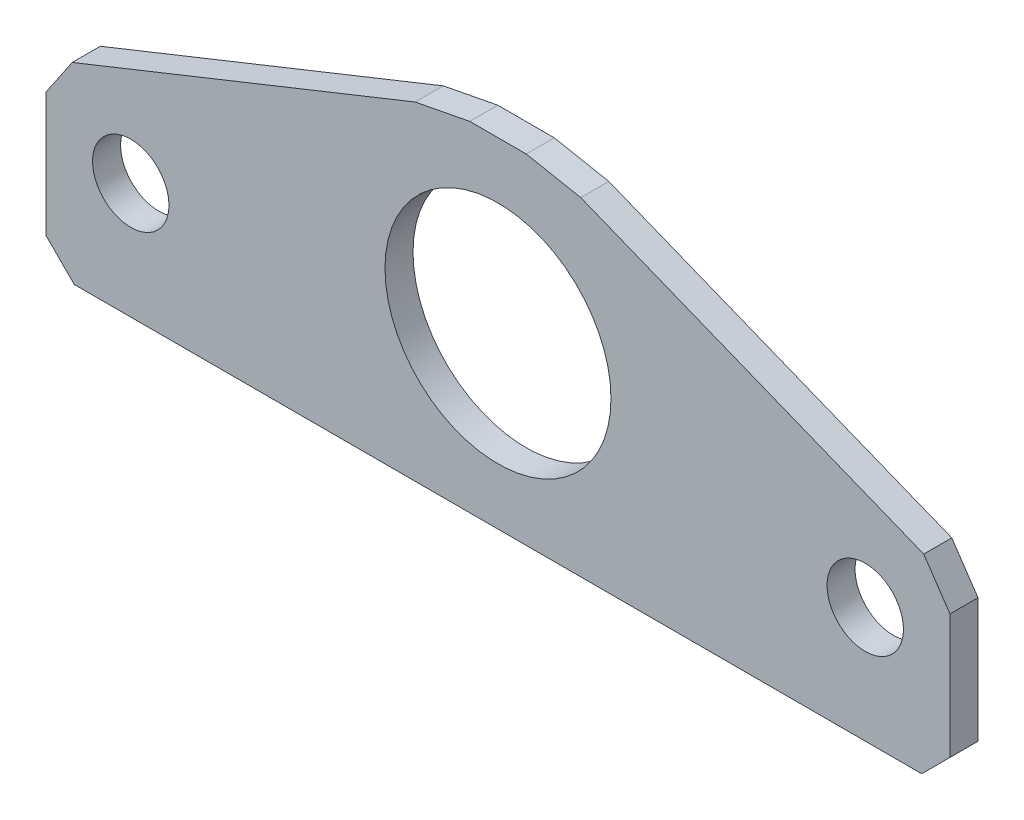
ISO-10303-21;
HEADER;
FILE_DESCRIPTION(('STEP AP214'),'2;1');
FILE_NAME('part.step','',(''),(''),'','','');
FILE_SCHEMA(('AUTOMOTIVE_DESIGN { 1 0 10303 214 1 1 1 1 }'));
ENDSEC;
DATA;
#1=APPLICATION_CONTEXT('core data for automotive mechanical design processes');
#2=APPLICATION_PROTOCOL_DEFINITION('international standard','automotive_design',2000,#1);
#3=PRODUCT_CONTEXT('',#1,'mechanical');
#4=PRODUCT('Part','Part','',(#3));
#5=PRODUCT_RELATED_PRODUCT_CATEGORY('part','',(#4));
#6=PRODUCT_DEFINITION_FORMATION('','',#4);
#7=PRODUCT_DEFINITION_CONTEXT('part definition',#1,'design');
#8=PRODUCT_DEFINITION('design','',#6,#7);
#9=PRODUCT_DEFINITION_SHAPE('','',#8);
#10=(LENGTH_UNIT() NAMED_UNIT(*) SI_UNIT(.MILLI.,.METRE.));
#11=(NAMED_UNIT(*) PLANE_ANGLE_UNIT() SI_UNIT($,.RADIAN.));
#12=(NAMED_UNIT(*) SI_UNIT($,.STERADIAN.) SOLID_ANGLE_UNIT());
#13=UNCERTAINTY_MEASURE_WITH_UNIT(LENGTH_MEASURE(1.E-05),#10,'distance_accuracy_value','');
#14=(GEOMETRIC_REPRESENTATION_CONTEXT(3) GLOBAL_UNCERTAINTY_ASSIGNED_CONTEXT((#13)) GLOBAL_UNIT_ASSIGNED_CONTEXT((#10,
#11,#12)) REPRESENTATION_CONTEXT('',''));
#15=CARTESIAN_POINT('',(0.,0.,0.));
#16=DIRECTION('',(0.,0.,1.));
#17=DIRECTION('',(1.,0.,0.));
#18=AXIS2_PLACEMENT_3D('',#15,#16,#17);
#19=CARTESIAN_POINT('',(25.4,20.955,1.5748));
#20=DIRECTION('',(0.,0.,-1.));
#21=DIRECTION('',(-1.,0.,0.));
#22=AXIS2_PLACEMENT_3D('',#19,#20,#21);
#23=PLANE('',#22);
#24=CARTESIAN_POINT('',(0.,0.,1.5748));
#25=DIRECTION('',(0.,0.,-1.));
#26=DIRECTION('',(-1.,0.,0.));
#27=AXIS2_PLACEMENT_3D('',#24,#25,#26);
#28=CIRCLE('',#27,6.35);
#29=CARTESIAN_POINT('',(-6.35,0.,1.5748));
#30=VERTEX_POINT('',#29);
#31=EDGE_CURVE('E138',#30,#30,#28,.T.);
#32=ORIENTED_EDGE('',*,*,#31,.T.);
#33=EDGE_LOOP('',(#32));
#34=FACE_BOUND('',#33,.T.);
#35=CARTESIAN_POINT('',(20.6375,-3.01285020999999,1.5748));
#36=DIRECTION('',(0.,0.,-1.));
#37=DIRECTION('',(-1.,0.,0.));
#38=AXIS2_PLACEMENT_3D('',#35,#36,#37);
#39=CIRCLE('',#38,2.1463);
#40=CARTESIAN_POINT('',(18.4912,-3.01285020999999,1.5748));
#41=VERTEX_POINT('',#40);
#42=EDGE_CURVE('E140',#41,#41,#39,.T.);
#43=ORIENTED_EDGE('',*,*,#42,.T.);
#44=EDGE_LOOP('',(#43));
#45=FACE_BOUND('',#44,.T.);
#46=DIRECTION('',(0.560628809305184,0.828067230469273,0.));
#47=VECTOR('',#46,1.);
#48=CARTESIAN_POINT('',(-25.4,-0.952500000000011,1.5748));
#49=LINE('',#48,#47);
#50=CARTESIAN_POINT('',(-23.9260432532196,1.22458269871214,1.5748));
#51=VERTEX_POINT('',#50);
#52=CARTESIAN_POINT('',(-25.4,-0.952500000000013,1.5748));
#53=VERTEX_POINT('',#52);
#54=EDGE_CURVE('E119',#51,#53,#49,.F.);
#55=ORIENTED_EDGE('',*,*,#54,.T.);
#56=DIRECTION('',(0.,1.,0.));
#57=VECTOR('',#56,1.);
#58=CARTESIAN_POINT('',(-25.4,0.635,1.5748));
#59=LINE('',#58,#57);
#60=CARTESIAN_POINT('',(-25.4,-7.9375,1.5748));
#61=VERTEX_POINT('',#60);
#62=EDGE_CURVE('E109',#53,#61,#59,.F.);
#63=ORIENTED_EDGE('',*,*,#62,.T.);
#64=DIRECTION('',(-0.707106781186547,0.707106781186548,0.));
#65=VECTOR('',#64,1.);
#66=CARTESIAN_POINT('',(-23.8125,-9.525,1.5748));
#67=LINE('',#66,#65);
#68=CARTESIAN_POINT('',(-23.8125,-9.525,1.5748));
#69=VERTEX_POINT('',#68);
#70=EDGE_CURVE('E142',#61,#69,#67,.F.);
#71=ORIENTED_EDGE('',*,*,#70,.T.);
#72=DIRECTION('',(-1.,0.,0.));
#73=VECTOR('',#72,1.);
#74=CARTESIAN_POINT('',(-25.4,-9.525,1.5748));
#75=LINE('',#74,#73);
#76=CARTESIAN_POINT('',(23.8125,-9.525,1.5748));
#77=VERTEX_POINT('',#76);
#78=EDGE_CURVE('E152',#69,#77,#75,.F.);
#79=ORIENTED_EDGE('',*,*,#78,.T.);
#80=DIRECTION('',(-0.707106781186547,-0.707106781186548,0.));
#81=VECTOR('',#80,1.);
#82=CARTESIAN_POINT('',(25.4,-7.93749999999999,1.5748));
#83=LINE('',#82,#81);
#84=CARTESIAN_POINT('',(25.4,-7.93749999999999,1.5748));
#85=VERTEX_POINT('',#84);
#86=EDGE_CURVE('E156',#77,#85,#83,.F.);
#87=ORIENTED_EDGE('',*,*,#86,.T.);
#88=DIRECTION('',(0.,-1.,0.));
#89=VECTOR('',#88,1.);
#90=CARTESIAN_POINT('',(25.4,0.635000000000006,1.5748));
#91=LINE('',#90,#89);
#92=CARTESIAN_POINT('',(25.4,-0.952500000000005,1.5748));
#93=VERTEX_POINT('',#92);
#94=EDGE_CURVE('E161',#85,#93,#91,.F.);
#95=ORIENTED_EDGE('',*,*,#94,.T.);
#96=DIRECTION('',(0.560628809305184,-0.828067230469273,0.));
#97=VECTOR('',#96,1.);
#98=CARTESIAN_POINT('',(23.9260432532196,1.22458269871215,1.5748));
#99=LINE('',#98,#97);
#100=CARTESIAN_POINT('',(23.9260432532196,1.22458269871215,1.5748));
#101=VERTEX_POINT('',#100);
#102=EDGE_CURVE('E166',#93,#101,#99,.F.);
#103=ORIENTED_EDGE('',*,*,#102,.T.);
#104=DIRECTION('',(0.928476690885259,-0.371390676354104,0.));
#105=VECTOR('',#104,1.);
#106=CARTESIAN_POINT('',(25.4,0.635000000000006,1.5748));
#107=LINE('',#106,#105);
#108=CARTESIAN_POINT('',(4.64895674678047,8.93541730128782,1.5748));
#109=VERTEX_POINT('',#108);
#110=EDGE_CURVE('E171',#101,#109,#107,.F.);
#111=ORIENTED_EDGE('',*,*,#110,.T.);
#112=DIRECTION('',(0.981956386731422,-0.189107521154951,0.));
#113=VECTOR('',#112,1.);
#114=CARTESIAN_POINT('',(1.58749999999997,9.525,1.5748));
#115=LINE('',#114,#113);
#116=CARTESIAN_POINT('',(1.5874999999999,9.525,1.5748));
#117=VERTEX_POINT('',#116);
#118=EDGE_CURVE('E176',#109,#117,#115,.F.);
#119=ORIENTED_EDGE('',*,*,#118,.T.);
#120=DIRECTION('',(1.,0.,0.));
#121=VECTOR('',#120,1.);
#122=CARTESIAN_POINT('',(-3.175,9.525,1.5748));
#123=LINE('',#122,#121);
#124=CARTESIAN_POINT('',(-1.58749999999997,9.525,1.5748));
#125=VERTEX_POINT('',#124);
#126=EDGE_CURVE('E181',#117,#125,#123,.F.);
#127=ORIENTED_EDGE('',*,*,#126,.T.);
#128=DIRECTION('',(0.981956386731422,0.189107521154951,0.));
#129=VECTOR('',#128,1.);
#130=CARTESIAN_POINT('',(-4.64895674678038,8.93541730128785,1.5748));
#131=LINE('',#130,#129);
#132=CARTESIAN_POINT('',(-4.64895674678053,8.93541730128779,1.5748));
#133=VERTEX_POINT('',#132);
#134=EDGE_CURVE('E186',#125,#133,#131,.F.);
#135=ORIENTED_EDGE('',*,*,#134,.T.);
#136=DIRECTION('',(0.928476690885259,0.371390676354104,0.));
#137=VECTOR('',#136,1.);
#138=CARTESIAN_POINT('',(-25.4,0.635,1.5748));
#139=LINE('',#138,#137);
#140=EDGE_CURVE('E104',#133,#51,#139,.F.);
#141=ORIENTED_EDGE('',*,*,#140,.T.);
#142=EDGE_LOOP('',(#55,#63,#71,#79,#87,#95,#103,#111,#119,#127,#135,#141));
#143=FACE_BOUND('',#142,.T.);
#144=CARTESIAN_POINT('',(-20.6375,-3.01285021,1.5748));
#145=DIRECTION('',(0.,0.,-1.));
#146=DIRECTION('',(-1.,0.,0.));
#147=AXIS2_PLACEMENT_3D('',#144,#145,#146);
#148=CIRCLE('',#147,2.1463);
#149=CARTESIAN_POINT('',(-22.7838,-3.01285021,1.5748));
#150=VERTEX_POINT('',#149);
#151=EDGE_CURVE('E21',#150,#150,#148,.T.);
#152=ORIENTED_EDGE('',*,*,#151,.T.);
#153=EDGE_LOOP('',(#152));
#154=FACE_BOUND('',#153,.T.);
#155=ADVANCED_FACE('F18',(#34,#45,#143,#154),#23,.F.);
#156=CARTESIAN_POINT('',(-20.6375,-3.01285021,1.5748));
#157=DIRECTION('',(0.,0.,-1.));
#158=DIRECTION('',(-1.,0.,0.));
#159=AXIS2_PLACEMENT_3D('',#156,#157,#158);
#160=CYLINDRICAL_SURFACE('',#159,2.1463);
#161=ORIENTED_EDGE('',*,*,#151,.F.);
#162=EDGE_LOOP('',(#161));
#163=FACE_BOUND('',#162,.T.);
#164=CARTESIAN_POINT('',(-20.6375,-3.01285021,0.));
#165=DIRECTION('',(0.,0.,-1.));
#166=DIRECTION('',(-1.,0.,0.));
#167=AXIS2_PLACEMENT_3D('',#164,#165,#166);
#168=CIRCLE('',#167,2.1463);
#169=CARTESIAN_POINT('',(-22.7838,-3.01285021,0.));
#170=VERTEX_POINT('',#169);
#171=EDGE_CURVE('E134',#170,#170,#168,.F.);
#172=ORIENTED_EDGE('',*,*,#171,.F.);
#173=EDGE_LOOP('',(#172));
#174=FACE_BOUND('',#173,.T.);
#175=ADVANCED_FACE('F262',(#163,#174),#160,.F.);
#176=CARTESIAN_POINT('',(-25.4,0.635,1.5748));
#177=DIRECTION('',(1.,0.,0.));
#178=DIRECTION('',(0.,0.,-1.));
#179=AXIS2_PLACEMENT_3D('',#176,#177,#178);
#180=PLANE('',#179);
#181=DIRECTION('',(0.,0.,1.));
#182=VECTOR('',#181,1.);
#183=CARTESIAN_POINT('',(-25.4,-0.952500000000011,1.5748));
#184=LINE('',#183,#182);
#185=CARTESIAN_POINT('',(-25.4,-0.952500000000015,0.));
#186=VERTEX_POINT('',#185);
#187=EDGE_CURVE('E112',#53,#186,#184,.F.);
#188=ORIENTED_EDGE('',*,*,#187,.T.);
#189=DIRECTION('',(0.,1.,0.));
#190=VECTOR('',#189,1.);
#191=CARTESIAN_POINT('',(-25.4,20.955,0.));
#192=LINE('',#191,#190);
#193=CARTESIAN_POINT('',(-25.4,-7.9375,0.));
#194=VERTEX_POINT('',#193);
#195=EDGE_CURVE('E137',#194,#186,#192,.T.);
#196=ORIENTED_EDGE('',*,*,#195,.F.);
#197=DIRECTION('',(0.,0.,1.));
#198=VECTOR('',#197,1.);
#199=CARTESIAN_POINT('',(-25.4,-7.9375,1.5748));
#200=LINE('',#199,#198);
#201=EDGE_CURVE('E115',#194,#61,#200,.T.);
#202=ORIENTED_EDGE('',*,*,#201,.T.);
#203=ORIENTED_EDGE('',*,*,#62,.F.);
#204=EDGE_LOOP('',(#188,#196,#202,#203));
#205=FACE_BOUND('',#204,.T.);
#206=ADVANCED_FACE('F110',(#205),#180,.F.);
#207=CARTESIAN_POINT('',(-25.4,-0.952500000000011,1.5748));
#208=DIRECTION('',(0.828067230469273,-0.560628809305184,0.));
#209=DIRECTION('',(0.560628809305184,0.828067230469273,0.));
#210=AXIS2_PLACEMENT_3D('',#207,#208,#209);
#211=PLANE('',#210);
#212=DIRECTION('',(0.,0.,1.));
#213=VECTOR('',#212,1.);
#214=CARTESIAN_POINT('',(-23.9260432532196,1.22458269871214,1.5748));
#215=LINE('',#214,#213);
#216=CARTESIAN_POINT('',(-23.9260432532196,1.22458269871214,0.));
#217=VERTEX_POINT('',#216);
#218=EDGE_CURVE('E190',#51,#217,#215,.F.);
#219=ORIENTED_EDGE('',*,*,#218,.T.);
#220=DIRECTION('',(0.560628809305184,0.828067230469273,0.));
#221=VECTOR('',#220,1.);
#222=CARTESIAN_POINT('',(-25.4,-0.952500000000016,0.));
#223=LINE('',#222,#221);
#224=EDGE_CURVE('E126',#186,#217,#223,.T.);
#225=ORIENTED_EDGE('',*,*,#224,.F.);
#226=ORIENTED_EDGE('',*,*,#187,.F.);
#227=ORIENTED_EDGE('',*,*,#54,.F.);
#228=EDGE_LOOP('',(#219,#225,#226,#227));
#229=FACE_BOUND('',#228,.T.);
#230=ADVANCED_FACE('F124',(#229),#211,.F.);
#231=CARTESIAN_POINT('',(-25.4,0.635,1.5748));
#232=DIRECTION('',(0.371390676354104,-0.928476690885259,0.));
#233=DIRECTION('',(0.928476690885259,0.371390676354104,0.));
#234=AXIS2_PLACEMENT_3D('',#231,#232,#233);
#235=PLANE('',#234);
#236=ORIENTED_EDGE('',*,*,#218,.F.);
#237=ORIENTED_EDGE('',*,*,#140,.F.);
#238=DIRECTION('',(0.,0.,1.));
#239=VECTOR('',#238,1.);
#240=CARTESIAN_POINT('',(-4.64895674678036,8.93541730128785,1.5748));
#241=LINE('',#240,#239);
#242=CARTESIAN_POINT('',(-4.64895674678062,8.93541730128776,0.));
#243=VERTEX_POINT('',#242);
#244=EDGE_CURVE('E188',#133,#243,#241,.F.);
#245=ORIENTED_EDGE('',*,*,#244,.T.);
#246=DIRECTION('',(0.928476690885259,0.371390676354105,0.));
#247=VECTOR('',#246,1.);
#248=CARTESIAN_POINT('',(-23.9260432532196,1.22458269871215,0.));
#249=LINE('',#248,#247);
#250=EDGE_CURVE('E194',#217,#243,#249,.T.);
#251=ORIENTED_EDGE('',*,*,#250,.F.);
#252=EDGE_LOOP('',(#236,#237,#245,#251));
#253=FACE_BOUND('',#252,.T.);
#254=ADVANCED_FACE('F195',(#253),#235,.F.);
#255=CARTESIAN_POINT('',(-4.64895674678038,8.93541730128785,1.5748));
#256=DIRECTION('',(0.189107521154951,-0.981956386731422,0.));
#257=DIRECTION('',(0.981956386731422,0.189107521154951,0.));
#258=AXIS2_PLACEMENT_3D('',#255,#256,#257);
#259=PLANE('',#258);
#260=DIRECTION('',(0.,0.,-1.));
#261=VECTOR('',#260,1.);
#262=CARTESIAN_POINT('',(-1.58749999999998,9.525,1.5748));
#263=LINE('',#262,#261);
#264=CARTESIAN_POINT('',(-1.58749999999997,9.525,0.));
#265=VERTEX_POINT('',#264);
#266=EDGE_CURVE('E184',#125,#265,#263,.T.);
#267=ORIENTED_EDGE('',*,*,#266,.T.);
#268=DIRECTION('',(0.98195638673142,0.189107521154962,0.));
#269=VECTOR('',#268,1.);
#270=CARTESIAN_POINT('',(-4.64895674678072,8.93541730128775,0.));
#271=LINE('',#270,#269);
#272=EDGE_CURVE('E200',#243,#265,#271,.T.);
#273=ORIENTED_EDGE('',*,*,#272,.F.);
#274=ORIENTED_EDGE('',*,*,#244,.F.);
#275=ORIENTED_EDGE('',*,*,#134,.F.);
#276=EDGE_LOOP('',(#267,#273,#274,#275));
#277=FACE_BOUND('',#276,.T.);
#278=ADVANCED_FACE('F277',(#277),#259,.F.);
#279=CARTESIAN_POINT('',(-3.175,9.525,1.5748));
#280=DIRECTION('',(0.,-1.,0.));
#281=DIRECTION('',(0.,0.,-1.));
#282=AXIS2_PLACEMENT_3D('',#279,#280,#281);
#283=PLANE('',#282);
#284=DIRECTION('',(0.,0.,1.));
#285=VECTOR('',#284,1.);
#286=CARTESIAN_POINT('',(1.58749999999994,9.52500000000001,1.5748));
#287=LINE('',#286,#285);
#288=CARTESIAN_POINT('',(1.58749999999984,9.525,0.));
#289=VERTEX_POINT('',#288);
#290=EDGE_CURVE('E179',#117,#289,#287,.F.);
#291=ORIENTED_EDGE('',*,*,#290,.T.);
#292=DIRECTION('',(-1.,0.,0.));
#293=VECTOR('',#292,1.);
#294=CARTESIAN_POINT('',(25.4,9.525,0.));
#295=LINE('',#294,#293);
#296=EDGE_CURVE('E208',#265,#289,#295,.F.);
#297=ORIENTED_EDGE('',*,*,#296,.F.);
#298=ORIENTED_EDGE('',*,*,#266,.F.);
#299=ORIENTED_EDGE('',*,*,#126,.F.);
#300=EDGE_LOOP('',(#291,#297,#298,#299));
#301=FACE_BOUND('',#300,.T.);
#302=ADVANCED_FACE('F280',(#301),#283,.F.);
#303=CARTESIAN_POINT('',(1.58749999999997,9.525,1.5748));
#304=DIRECTION('',(-0.189107521154951,-0.981956386731422,0.));
#305=DIRECTION('',(0.981956386731422,-0.189107521154951,0.));
#306=AXIS2_PLACEMENT_3D('',#303,#304,#305);
#307=PLANE('',#306);
#308=DIRECTION('',(0.,0.,1.));
#309=VECTOR('',#308,1.);
#310=CARTESIAN_POINT('',(4.64895674678057,8.93541730128777,1.5748));
#311=LINE('',#310,#309);
#312=CARTESIAN_POINT('',(4.64895674678042,8.93541730128784,0.));
#313=VERTEX_POINT('',#312);
#314=EDGE_CURVE('E174',#109,#313,#311,.F.);
#315=ORIENTED_EDGE('',*,*,#314,.T.);
#316=DIRECTION('',(0.981956386731423,-0.189107521154944,0.));
#317=VECTOR('',#316,1.);
#318=CARTESIAN_POINT('',(1.58749999999977,9.52500000000002,0.));
#319=LINE('',#318,#317);
#320=EDGE_CURVE('E211',#289,#313,#319,.T.);
#321=ORIENTED_EDGE('',*,*,#320,.F.);
#322=ORIENTED_EDGE('',*,*,#290,.F.);
#323=ORIENTED_EDGE('',*,*,#118,.F.);
#324=EDGE_LOOP('',(#315,#321,#322,#323));
#325=FACE_BOUND('',#324,.T.);
#326=ADVANCED_FACE('F284',(#325),#307,.F.);
#327=CARTESIAN_POINT('',(25.4,0.635000000000006,1.5748));
#328=DIRECTION('',(-0.371390676354104,-0.928476690885259,0.));
#329=DIRECTION('',(0.928476690885259,-0.371390676354104,0.));
#330=AXIS2_PLACEMENT_3D('',#327,#328,#329);
#331=PLANE('',#330);
#332=DIRECTION('',(0.,0.,1.));
#333=VECTOR('',#332,1.);
#334=CARTESIAN_POINT('',(23.9260432532196,1.22458269871215,1.5748));
#335=LINE('',#334,#333);
#336=CARTESIAN_POINT('',(23.9260432532196,1.22458269871215,0.));
#337=VERTEX_POINT('',#336);
#338=EDGE_CURVE('E169',#101,#337,#335,.F.);
#339=ORIENTED_EDGE('',*,*,#338,.T.);
#340=DIRECTION('',(0.928476690885259,-0.371390676354104,0.));
#341=VECTOR('',#340,1.);
#342=CARTESIAN_POINT('',(4.64895674678038,8.93541730128785,0.));
#343=LINE('',#342,#341);
#344=EDGE_CURVE('E214',#313,#337,#343,.T.);
#345=ORIENTED_EDGE('',*,*,#344,.F.);
#346=ORIENTED_EDGE('',*,*,#314,.F.);
#347=ORIENTED_EDGE('',*,*,#110,.F.);
#348=EDGE_LOOP('',(#339,#345,#346,#347));
#349=FACE_BOUND('',#348,.T.);
#350=ADVANCED_FACE('F288',(#349),#331,.F.);
#351=CARTESIAN_POINT('',(23.9260432532196,1.22458269871215,1.5748));
#352=DIRECTION('',(-0.828067230469273,-0.560628809305184,0.));
#353=DIRECTION('',(0.560628809305184,-0.828067230469273,0.));
#354=AXIS2_PLACEMENT_3D('',#351,#352,#353);
#355=PLANE('',#354);
#356=DIRECTION('',(0.,0.,1.));
#357=VECTOR('',#356,1.);
#358=CARTESIAN_POINT('',(25.4,-0.952500000000007,1.5748));
#359=LINE('',#358,#357);
#360=CARTESIAN_POINT('',(25.4,-0.952500000000005,0.));
#361=VERTEX_POINT('',#360);
#362=EDGE_CURVE('E164',#93,#361,#359,.F.);
#363=ORIENTED_EDGE('',*,*,#362,.T.);
#364=DIRECTION('',(0.560628809305184,-0.828067230469273,0.));
#365=VECTOR('',#364,1.);
#366=CARTESIAN_POINT('',(23.9260432532196,1.22458269871215,0.));
#367=LINE('',#366,#365);
#368=EDGE_CURVE('E217',#337,#361,#367,.T.);
#369=ORIENTED_EDGE('',*,*,#368,.F.);
#370=ORIENTED_EDGE('',*,*,#338,.F.);
#371=ORIENTED_EDGE('',*,*,#102,.F.);
#372=EDGE_LOOP('',(#363,#369,#370,#371));
#373=FACE_BOUND('',#372,.T.);
#374=ADVANCED_FACE('F292',(#373),#355,.F.);
#375=CARTESIAN_POINT('',(25.4,0.635000000000006,1.5748));
#376=DIRECTION('',(-1.,0.,0.));
#377=DIRECTION('',(0.,-1.,0.));
#378=AXIS2_PLACEMENT_3D('',#375,#376,#377);
#379=PLANE('',#378);
#380=DIRECTION('',(0.,0.,1.));
#381=VECTOR('',#380,1.);
#382=CARTESIAN_POINT('',(25.4,-7.93749999999999,1.5748));
#383=LINE('',#382,#381);
#384=CARTESIAN_POINT('',(25.4,-7.93749999999999,0.));
#385=VERTEX_POINT('',#384);
#386=EDGE_CURVE('E159',#85,#385,#383,.F.);
#387=ORIENTED_EDGE('',*,*,#386,.T.);
#388=DIRECTION('',(0.,1.,0.));
#389=VECTOR('',#388,1.);
#390=CARTESIAN_POINT('',(25.4,20.955,0.));
#391=LINE('',#390,#389);
#392=EDGE_CURVE('E220',#361,#385,#391,.F.);
#393=ORIENTED_EDGE('',*,*,#392,.F.);
#394=ORIENTED_EDGE('',*,*,#362,.F.);
#395=ORIENTED_EDGE('',*,*,#94,.F.);
#396=EDGE_LOOP('',(#387,#393,#394,#395));
#397=FACE_BOUND('',#396,.T.);
#398=ADVANCED_FACE('F296',(#397),#379,.F.);
#399=CARTESIAN_POINT('',(25.4,-7.93749999999999,1.5748));
#400=DIRECTION('',(-0.707106781186548,0.707106781186547,0.));
#401=DIRECTION('',(-0.707106781186547,-0.707106781186548,0.));
#402=AXIS2_PLACEMENT_3D('',#399,#400,#401);
#403=PLANE('',#402);
#404=DIRECTION('',(0.,0.,1.));
#405=VECTOR('',#404,1.);
#406=CARTESIAN_POINT('',(23.8125,-9.52499999999999,1.5748));
#407=LINE('',#406,#405);
#408=CARTESIAN_POINT('',(23.8125,-9.525,0.));
#409=VERTEX_POINT('',#408);
#410=EDGE_CURVE('E154',#77,#409,#407,.F.);
#411=ORIENTED_EDGE('',*,*,#410,.T.);
#412=DIRECTION('',(-0.707106781186546,-0.707106781186549,0.));
#413=VECTOR('',#412,1.);
#414=CARTESIAN_POINT('',(25.4,-7.93749999999999,0.));
#415=LINE('',#414,#413);
#416=EDGE_CURVE('E223',#385,#409,#415,.T.);
#417=ORIENTED_EDGE('',*,*,#416,.F.);
#418=ORIENTED_EDGE('',*,*,#386,.F.);
#419=ORIENTED_EDGE('',*,*,#86,.F.);
#420=EDGE_LOOP('',(#411,#417,#418,#419));
#421=FACE_BOUND('',#420,.T.);
#422=ADVANCED_FACE('F242',(#421),#403,.F.);
#423=CARTESIAN_POINT('',(-25.4,-9.525,1.5748));
#424=DIRECTION('',(0.,1.,0.));
#425=DIRECTION('',(-1.,0.,0.));
#426=AXIS2_PLACEMENT_3D('',#423,#424,#425);
#427=PLANE('',#426);
#428=DIRECTION('',(0.,0.,1.));
#429=VECTOR('',#428,1.);
#430=CARTESIAN_POINT('',(-23.8125,-9.525,1.5748));
#431=LINE('',#430,#429);
#432=CARTESIAN_POINT('',(-23.8125,-9.525,0.));
#433=VERTEX_POINT('',#432);
#434=EDGE_CURVE('E36',#69,#433,#431,.F.);
#435=ORIENTED_EDGE('',*,*,#434,.T.);
#436=DIRECTION('',(-1.,0.,0.));
#437=VECTOR('',#436,1.);
#438=CARTESIAN_POINT('',(25.4,-9.525,0.));
#439=LINE('',#438,#437);
#440=EDGE_CURVE('E226',#409,#433,#439,.T.);
#441=ORIENTED_EDGE('',*,*,#440,.F.);
#442=ORIENTED_EDGE('',*,*,#410,.F.);
#443=ORIENTED_EDGE('',*,*,#78,.F.);
#444=EDGE_LOOP('',(#435,#441,#442,#443));
#445=FACE_BOUND('',#444,.T.);
#446=ADVANCED_FACE('F232',(#445),#427,.F.);
#447=CARTESIAN_POINT('',(-23.8125,-9.525,1.5748));
#448=DIRECTION('',(0.707106781186548,0.707106781186547,0.));
#449=DIRECTION('',(-0.707106781186547,0.707106781186548,0.));
#450=AXIS2_PLACEMENT_3D('',#447,#448,#449);
#451=PLANE('',#450);
#452=ORIENTED_EDGE('',*,*,#201,.F.);
#453=DIRECTION('',(-0.707106781186544,0.707106781186551,0.));
#454=VECTOR('',#453,1.);
#455=CARTESIAN_POINT('',(-23.8125,-9.525,0.));
#456=LINE('',#455,#454);
#457=EDGE_CURVE('E133',#433,#194,#456,.T.);
#458=ORIENTED_EDGE('',*,*,#457,.F.);
#459=ORIENTED_EDGE('',*,*,#434,.F.);
#460=ORIENTED_EDGE('',*,*,#70,.F.);
#461=EDGE_LOOP('',(#452,#458,#459,#460));
#462=FACE_BOUND('',#461,.T.);
#463=ADVANCED_FACE('F229',(#462),#451,.F.);
#464=CARTESIAN_POINT('',(20.6375,-3.01285020999999,1.5748));
#465=DIRECTION('',(0.,0.,-1.));
#466=DIRECTION('',(-1.,0.,0.));
#467=AXIS2_PLACEMENT_3D('',#464,#465,#466);
#468=CYLINDRICAL_SURFACE('',#467,2.1463);
#469=ORIENTED_EDGE('',*,*,#42,.F.);
#470=EDGE_LOOP('',(#469));
#471=FACE_BOUND('',#470,.T.);
#472=CARTESIAN_POINT('',(20.6375,-3.01285020999999,0.));
#473=DIRECTION('',(0.,0.,-1.));
#474=DIRECTION('',(-1.,0.,0.));
#475=AXIS2_PLACEMENT_3D('',#472,#473,#474);
#476=CIRCLE('',#475,2.1463);
#477=CARTESIAN_POINT('',(18.4912,-3.01285020999999,0.));
#478=VERTEX_POINT('',#477);
#479=EDGE_CURVE('E27',#478,#478,#476,.F.);
#480=ORIENTED_EDGE('',*,*,#479,.F.);
#481=EDGE_LOOP('',(#480));
#482=FACE_BOUND('',#481,.T.);
#483=ADVANCED_FACE('F231',(#471,#482),#468,.F.);
#484=CARTESIAN_POINT('',(0.,0.,1.5748));
#485=DIRECTION('',(0.,0.,-1.));
#486=DIRECTION('',(-1.,0.,0.));
#487=AXIS2_PLACEMENT_3D('',#484,#485,#486);
#488=CYLINDRICAL_SURFACE('',#487,6.35);
#489=ORIENTED_EDGE('',*,*,#31,.F.);
#490=EDGE_LOOP('',(#489));
#491=FACE_BOUND('',#490,.T.);
#492=CARTESIAN_POINT('',(0.,0.,0.));
#493=DIRECTION('',(0.,0.,-1.));
#494=DIRECTION('',(-1.,0.,0.));
#495=AXIS2_PLACEMENT_3D('',#492,#493,#494);
#496=CIRCLE('',#495,6.35);
#497=CARTESIAN_POINT('',(-6.35,0.,0.));
#498=VERTEX_POINT('',#497);
#499=EDGE_CURVE('E11',#498,#498,#496,.F.);
#500=ORIENTED_EDGE('',*,*,#499,.F.);
#501=EDGE_LOOP('',(#500));
#502=FACE_BOUND('',#501,.T.);
#503=ADVANCED_FACE('F239',(#491,#502),#488,.F.);
#504=CARTESIAN_POINT('',(25.4,20.955,0.));
#505=DIRECTION('',(0.,0.,-1.));
#506=DIRECTION('',(-1.,0.,0.));
#507=AXIS2_PLACEMENT_3D('',#504,#505,#506);
#508=PLANE('',#507);
#509=ORIENTED_EDGE('',*,*,#499,.T.);
#510=EDGE_LOOP('',(#509));
#511=FACE_BOUND('',#510,.T.);
#512=ORIENTED_EDGE('',*,*,#479,.T.);
#513=EDGE_LOOP('',(#512));
#514=FACE_BOUND('',#513,.T.);
#515=ORIENTED_EDGE('',*,*,#440,.T.);
#516=ORIENTED_EDGE('',*,*,#457,.T.);
#517=ORIENTED_EDGE('',*,*,#195,.T.);
#518=ORIENTED_EDGE('',*,*,#224,.T.);
#519=ORIENTED_EDGE('',*,*,#250,.T.);
#520=ORIENTED_EDGE('',*,*,#272,.T.);
#521=ORIENTED_EDGE('',*,*,#296,.T.);
#522=ORIENTED_EDGE('',*,*,#320,.T.);
#523=ORIENTED_EDGE('',*,*,#344,.T.);
#524=ORIENTED_EDGE('',*,*,#368,.T.);
#525=ORIENTED_EDGE('',*,*,#392,.T.);
#526=ORIENTED_EDGE('',*,*,#416,.T.);
#527=EDGE_LOOP('',(#515,#516,#517,#518,#519,#520,#521,#522,#523,#524,#525,#526));
#528=FACE_BOUND('',#527,.T.);
#529=ORIENTED_EDGE('',*,*,#171,.T.);
#530=EDGE_LOOP('',(#529));
#531=FACE_BOUND('',#530,.T.);
#532=ADVANCED_FACE('F203',(#511,#514,#528,#531),#508,.T.);
#533=CLOSED_SHELL('',(#155,#175,#206,#230,#254,#278,#302,#326,#350,#374,#398,#422,#446,#463,
#483,#503,#532));
#534=MANIFOLD_SOLID_BREP('B1',#533);
#535=ADVANCED_BREP_SHAPE_REPRESENTATION('',(#18,#534),#14);
#536=SHAPE_DEFINITION_REPRESENTATION(#9,#535);
ENDSEC;
END-ISO-10303-21;
